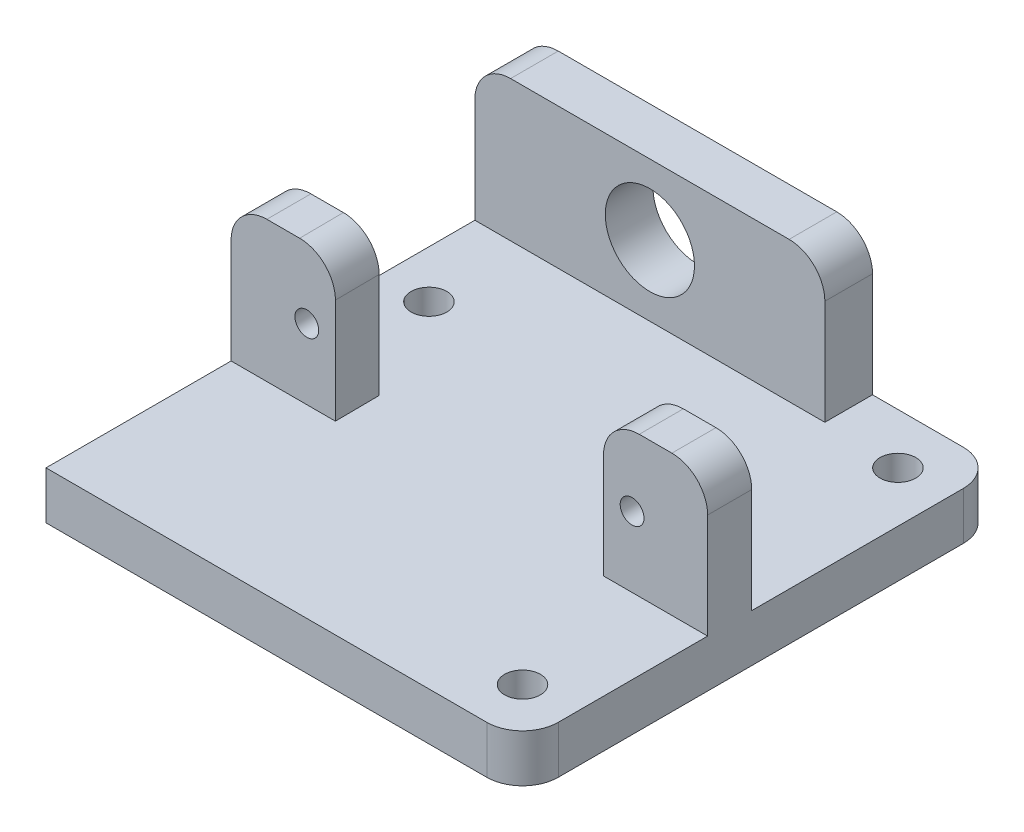
ISO-10303-21;
HEADER;
FILE_DESCRIPTION(('STEP AP214'),'2;1');
FILE_NAME('part.step','',(''),(''),'','','');
FILE_SCHEMA(('AUTOMOTIVE_DESIGN { 1 0 10303 214 1 1 1 1 }'));
ENDSEC;
DATA;
#1=APPLICATION_CONTEXT('core data for automotive mechanical design processes');
#2=APPLICATION_PROTOCOL_DEFINITION('international standard','automotive_design',2000,#1);
#3=PRODUCT_CONTEXT('',#1,'mechanical');
#4=PRODUCT('Part','Part','',(#3));
#5=PRODUCT_RELATED_PRODUCT_CATEGORY('part','',(#4));
#6=PRODUCT_DEFINITION_FORMATION('','',#4);
#7=PRODUCT_DEFINITION_CONTEXT('part definition',#1,'design');
#8=PRODUCT_DEFINITION('design','',#6,#7);
#9=PRODUCT_DEFINITION_SHAPE('','',#8);
#10=(LENGTH_UNIT() NAMED_UNIT(*) SI_UNIT(.MILLI.,.METRE.));
#11=(NAMED_UNIT(*) PLANE_ANGLE_UNIT() SI_UNIT($,.RADIAN.));
#12=(NAMED_UNIT(*) SI_UNIT($,.STERADIAN.) SOLID_ANGLE_UNIT());
#13=UNCERTAINTY_MEASURE_WITH_UNIT(LENGTH_MEASURE(1.E-05),#10,'distance_accuracy_value','');
#14=(GEOMETRIC_REPRESENTATION_CONTEXT(3) GLOBAL_UNCERTAINTY_ASSIGNED_CONTEXT((#13)) GLOBAL_UNIT_ASSIGNED_CONTEXT((#10,
#11,#12)) REPRESENTATION_CONTEXT('',''));
#15=CARTESIAN_POINT('',(0.,0.,0.));
#16=DIRECTION('',(0.,0.,1.));
#17=DIRECTION('',(1.,0.,0.));
#18=AXIS2_PLACEMENT_3D('',#15,#16,#17);
#19=CARTESIAN_POINT('',(0.,4.,0.));
#20=DIRECTION('',(0.,-1.,0.));
#21=DIRECTION('',(0.,0.,-1.));
#22=AXIS2_PLACEMENT_3D('',#19,#20,#21);
#23=PLANE('',#22);
#24=CARTESIAN_POINT('',(15.7573593128807,4.,-15.7573593128807));
#25=DIRECTION('',(0.,1.,0.));
#26=DIRECTION('',(0.,0.,1.));
#27=AXIS2_PLACEMENT_3D('',#24,#25,#26);
#28=CIRCLE('',#27,1.5);
#29=CARTESIAN_POINT('',(15.7573593128807,4.,-14.2573593128807));
#30=VERTEX_POINT('',#29);
#31=EDGE_CURVE('E417',#30,#30,#28,.T.);
#32=ORIENTED_EDGE('',*,*,#31,.F.);
#33=EDGE_LOOP('',(#32));
#34=FACE_BOUND('',#33,.T.);
#35=CARTESIAN_POINT('',(15.7573593128807,4.,15.7573593128807));
#36=DIRECTION('',(0.,1.,0.));
#37=DIRECTION('',(0.,0.,1.));
#38=AXIS2_PLACEMENT_3D('',#35,#36,#37);
#39=CIRCLE('',#38,1.5);
#40=CARTESIAN_POINT('',(15.7573593128807,4.,17.2573593128807));
#41=VERTEX_POINT('',#40);
#42=EDGE_CURVE('E423',#41,#41,#39,.T.);
#43=ORIENTED_EDGE('',*,*,#42,.F.);
#44=EDGE_LOOP('',(#43));
#45=FACE_BOUND('',#44,.T.);
#46=CARTESIAN_POINT('',(-16.,4.,-8.14578966185309));
#47=DIRECTION('',(0.,1.,0.));
#48=DIRECTION('',(0.,0.,1.));
#49=AXIS2_PLACEMENT_3D('',#46,#47,#48);
#50=CIRCLE('',#49,1.5);
#51=CARTESIAN_POINT('',(-16.,4.,-6.64578966185308));
#52=VERTEX_POINT('',#51);
#53=EDGE_CURVE('E414',#52,#52,#50,.T.);
#54=ORIENTED_EDGE('',*,*,#53,.F.);
#55=EDGE_LOOP('',(#54));
#56=FACE_BOUND('',#55,.T.);
#57=DIRECTION('',(0.,0.,-1.));
#58=VECTOR('',#57,1.);
#59=CARTESIAN_POINT('',(20.,4.,20.));
#60=LINE('',#59,#58);
#61=CARTESIAN_POINT('',(20.,4.,0.761716698699549));
#62=VERTEX_POINT('',#61);
#63=CARTESIAN_POINT('',(20.,4.,-17.));
#64=VERTEX_POINT('',#63);
#65=EDGE_CURVE('E279',#62,#64,#60,.T.);
#66=ORIENTED_EDGE('',*,*,#65,.T.);
#67=CARTESIAN_POINT('',(17.,4.,-17.));
#68=DIRECTION('',(0.,-1.,0.));
#69=DIRECTION('',(0.,0.,-1.));
#70=AXIS2_PLACEMENT_3D('',#67,#68,#69);
#71=CIRCLE('',#70,3.);
#72=CARTESIAN_POINT('',(17.,4.,-20.));
#73=VERTEX_POINT('',#72);
#74=EDGE_CURVE('E42',#64,#73,#71,.F.);
#75=ORIENTED_EDGE('',*,*,#74,.T.);
#76=DIRECTION('',(-1.,0.,0.));
#77=VECTOR('',#76,1.);
#78=CARTESIAN_POINT('',(-20.,4.,-20.));
#79=LINE('',#78,#77);
#80=CARTESIAN_POINT('',(9.38,4.,-20.));
#81=VERTEX_POINT('',#80);
#82=EDGE_CURVE('E278',#73,#81,#79,.T.);
#83=ORIENTED_EDGE('',*,*,#82,.T.);
#84=DIRECTION('',(0.,0.,-1.));
#85=VECTOR('',#84,1.);
#86=CARTESIAN_POINT('',(9.38,4.,-16.));
#87=LINE('',#86,#85);
#88=CARTESIAN_POINT('',(9.38,4.,-16.));
#89=VERTEX_POINT('',#88);
#90=EDGE_CURVE('E217',#89,#81,#87,.T.);
#91=ORIENTED_EDGE('',*,*,#90,.F.);
#92=DIRECTION('',(1.,0.,0.));
#93=VECTOR('',#92,1.);
#94=CARTESIAN_POINT('',(9.38,4.,-16.));
#95=LINE('',#94,#93);
#96=CARTESIAN_POINT('',(-20.,4.,-16.));
#97=VERTEX_POINT('',#96);
#98=EDGE_CURVE('E196',#97,#89,#95,.T.);
#99=ORIENTED_EDGE('',*,*,#98,.F.);
#100=DIRECTION('',(0.,0.,1.));
#101=VECTOR('',#100,1.);
#102=CARTESIAN_POINT('',(-20.,4.,20.));
#103=LINE('',#102,#101);
#104=CARTESIAN_POINT('',(-20.,4.,0.761716698699547));
#105=VERTEX_POINT('',#104);
#106=EDGE_CURVE('E205',#97,#105,#103,.T.);
#107=ORIENTED_EDGE('',*,*,#106,.T.);
#108=DIRECTION('',(-1.,0.,0.));
#109=VECTOR('',#108,1.);
#110=CARTESIAN_POINT('',(-20.,4.,0.761716698699547));
#111=LINE('',#110,#109);
#112=CARTESIAN_POINT('',(-11.2760695865092,4.,0.761716698699547));
#113=VERTEX_POINT('',#112);
#114=EDGE_CURVE('E265',#113,#105,#111,.T.);
#115=ORIENTED_EDGE('',*,*,#114,.F.);
#116=DIRECTION('',(-0.00844114842498578,0.,-0.999964372871988));
#117=VECTOR('',#116,1.);
#118=CARTESIAN_POINT('',(-11.2760695865092,4.,0.761716698699547));
#119=LINE('',#118,#117);
#120=CARTESIAN_POINT('',(-11.2448362245817,4.,4.46171669869955));
#121=VERTEX_POINT('',#120);
#122=EDGE_CURVE('E254',#121,#113,#119,.T.);
#123=ORIENTED_EDGE('',*,*,#122,.F.);
#124=DIRECTION('',(1.,0.,0.));
#125=VECTOR('',#124,1.);
#126=CARTESIAN_POINT('',(-20.,4.,4.46171669869955));
#127=LINE('',#126,#125);
#128=CARTESIAN_POINT('',(-20.,4.,4.46171669869955));
#129=VERTEX_POINT('',#128);
#130=EDGE_CURVE('E259',#129,#121,#127,.T.);
#131=ORIENTED_EDGE('',*,*,#130,.F.);
#132=CARTESIAN_POINT('',(-20.,4.,20.));
#133=VERTEX_POINT('',#132);
#134=EDGE_CURVE('E213',#129,#133,#103,.T.);
#135=ORIENTED_EDGE('',*,*,#134,.T.);
#136=DIRECTION('',(1.,0.,0.));
#137=VECTOR('',#136,1.);
#138=CARTESIAN_POINT('',(-20.,4.,20.));
#139=LINE('',#138,#137);
#140=CARTESIAN_POINT('',(17.,4.,20.));
#141=VERTEX_POINT('',#140);
#142=EDGE_CURVE('E212',#133,#141,#139,.T.);
#143=ORIENTED_EDGE('',*,*,#142,.T.);
#144=CARTESIAN_POINT('',(17.,4.,17.));
#145=DIRECTION('',(0.,-1.,0.));
#146=DIRECTION('',(0.,0.,-1.));
#147=AXIS2_PLACEMENT_3D('',#144,#145,#146);
#148=CIRCLE('',#147,3.);
#149=CARTESIAN_POINT('',(20.,4.,17.));
#150=VERTEX_POINT('',#149);
#151=EDGE_CURVE('E359',#141,#150,#148,.F.);
#152=ORIENTED_EDGE('',*,*,#151,.T.);
#153=CARTESIAN_POINT('',(20.,4.,4.46171669869955));
#154=VERTEX_POINT('',#153);
#155=EDGE_CURVE('E276',#150,#154,#60,.T.);
#156=ORIENTED_EDGE('',*,*,#155,.T.);
#157=DIRECTION('',(1.,0.,0.));
#158=VECTOR('',#157,1.);
#159=CARTESIAN_POINT('',(11.2604529055455,4.,4.46171669869955));
#160=LINE('',#159,#158);
#161=CARTESIAN_POINT('',(11.2604529055455,4.,4.46171669869955));
#162=VERTEX_POINT('',#161);
#163=EDGE_CURVE('E235',#162,#154,#160,.T.);
#164=ORIENTED_EDGE('',*,*,#163,.F.);
#165=DIRECTION('',(0.,0.,1.));
#166=VECTOR('',#165,1.);
#167=CARTESIAN_POINT('',(11.2604529055455,4.,0.761716698699549));
#168=LINE('',#167,#166);
#169=CARTESIAN_POINT('',(11.2604529055455,4.,0.761716698699549));
#170=VERTEX_POINT('',#169);
#171=EDGE_CURVE('E241',#170,#162,#168,.T.);
#172=ORIENTED_EDGE('',*,*,#171,.F.);
#173=DIRECTION('',(-1.,0.,0.));
#174=VECTOR('',#173,1.);
#175=CARTESIAN_POINT('',(11.2604529055455,4.,0.761716698699549));
#176=LINE('',#175,#174);
#177=EDGE_CURVE('E230',#62,#170,#176,.T.);
#178=ORIENTED_EDGE('',*,*,#177,.F.);
#179=EDGE_LOOP('',(#66,#75,#83,#91,#99,#107,#115,#123,#131,#135,#143,#152,#156,#164,#172,#178));
#180=FACE_BOUND('',#179,.T.);
#181=ADVANCED_FACE('F34',(#34,#45,#56,#180),#23,.F.);
#182=CARTESIAN_POINT('',(20.,4.,20.));
#183=DIRECTION('',(-1.,0.,0.));
#184=DIRECTION('',(0.,0.,1.));
#185=AXIS2_PLACEMENT_3D('',#182,#183,#184);
#186=PLANE('',#185);
#187=DIRECTION('',(0.,0.,-1.));
#188=VECTOR('',#187,1.);
#189=CARTESIAN_POINT('',(20.,0.,20.));
#190=LINE('',#189,#188);
#191=CARTESIAN_POINT('',(20.,0.,17.));
#192=VERTEX_POINT('',#191);
#193=CARTESIAN_POINT('',(20.,0.,-17.));
#194=VERTEX_POINT('',#193);
#195=EDGE_CURVE('E275',#192,#194,#190,.T.);
#196=ORIENTED_EDGE('',*,*,#195,.T.);
#197=DIRECTION('',(0.,-1.,0.));
#198=VECTOR('',#197,1.);
#199=CARTESIAN_POINT('',(20.,4.,-17.));
#200=LINE('',#199,#198);
#201=EDGE_CURVE('E55',#194,#64,#200,.F.);
#202=ORIENTED_EDGE('',*,*,#201,.T.);
#203=ORIENTED_EDGE('',*,*,#65,.F.);
#204=DIRECTION('',(0.,-1.,0.));
#205=VECTOR('',#204,1.);
#206=CARTESIAN_POINT('',(20.,15.8,0.761716698699549));
#207=LINE('',#206,#205);
#208=CARTESIAN_POINT('',(20.,12.8,0.761716698699549));
#209=VERTEX_POINT('',#208);
#210=EDGE_CURVE('E252',#209,#62,#207,.T.);
#211=ORIENTED_EDGE('',*,*,#210,.F.);
#212=DIRECTION('',(0.,0.,-1.));
#213=VECTOR('',#212,1.);
#214=CARTESIAN_POINT('',(20.,12.8,4.46171669869955));
#215=LINE('',#214,#213);
#216=CARTESIAN_POINT('',(20.,12.8,4.46171669869955));
#217=VERTEX_POINT('',#216);
#218=EDGE_CURVE('E305',#209,#217,#215,.F.);
#219=ORIENTED_EDGE('',*,*,#218,.T.);
#220=DIRECTION('',(0.,-1.,0.));
#221=VECTOR('',#220,1.);
#222=CARTESIAN_POINT('',(20.,15.8,4.46171669869955));
#223=LINE('',#222,#221);
#224=EDGE_CURVE('E238',#217,#154,#223,.T.);
#225=ORIENTED_EDGE('',*,*,#224,.T.);
#226=ORIENTED_EDGE('',*,*,#155,.F.);
#227=DIRECTION('',(0.,-1.,0.));
#228=VECTOR('',#227,1.);
#229=CARTESIAN_POINT('',(20.,4.,17.));
#230=LINE('',#229,#228);
#231=EDGE_CURVE('E355',#150,#192,#230,.T.);
#232=ORIENTED_EDGE('',*,*,#231,.T.);
#233=EDGE_LOOP('',(#196,#202,#203,#211,#219,#225,#226,#232));
#234=FACE_BOUND('',#233,.T.);
#235=ADVANCED_FACE('F374',(#234),#186,.F.);
#236=CARTESIAN_POINT('',(-20.,4.,-20.));
#237=DIRECTION('',(0.,0.,1.));
#238=DIRECTION('',(1.,0.,0.));
#239=AXIS2_PLACEMENT_3D('',#236,#237,#238);
#240=PLANE('',#239);
#241=CARTESIAN_POINT('',(-5.31,9.9,-20.));
#242=DIRECTION('',(0.,0.,1.));
#243=DIRECTION('',(1.,0.,0.));
#244=AXIS2_PLACEMENT_3D('',#241,#242,#243);
#245=CIRCLE('',#244,3.745);
#246=CARTESIAN_POINT('',(-1.565,9.9,-20.));
#247=VERTEX_POINT('',#246);
#248=EDGE_CURVE('E223',#247,#247,#245,.T.);
#249=ORIENTED_EDGE('',*,*,#248,.T.);
#250=EDGE_LOOP('',(#249));
#251=FACE_BOUND('',#250,.T.);
#252=ORIENTED_EDGE('',*,*,#82,.F.);
#253=DIRECTION('',(0.,-1.,0.));
#254=VECTOR('',#253,1.);
#255=CARTESIAN_POINT('',(17.,4.,-20.));
#256=LINE('',#255,#254);
#257=CARTESIAN_POINT('',(17.,0.,-20.));
#258=VERTEX_POINT('',#257);
#259=EDGE_CURVE('E348',#73,#258,#256,.T.);
#260=ORIENTED_EDGE('',*,*,#259,.T.);
#261=DIRECTION('',(-1.,0.,0.));
#262=VECTOR('',#261,1.);
#263=CARTESIAN_POINT('',(-20.,0.,-20.));
#264=LINE('',#263,#262);
#265=CARTESIAN_POINT('',(-20.,0.,-20.));
#266=VERTEX_POINT('',#265);
#267=EDGE_CURVE('E284',#258,#266,#264,.T.);
#268=ORIENTED_EDGE('',*,*,#267,.T.);
#269=DIRECTION('',(0.,-1.,0.));
#270=VECTOR('',#269,1.);
#271=CARTESIAN_POINT('',(-20.,4.,-20.));
#272=LINE('',#271,#270);
#273=CARTESIAN_POINT('',(-20.,12.8,-20.));
#274=VERTEX_POINT('',#273);
#275=EDGE_CURVE('E292',#274,#266,#272,.T.);
#276=ORIENTED_EDGE('',*,*,#275,.F.);
#277=CARTESIAN_POINT('',(-17.,12.8,-20.));
#278=DIRECTION('',(0.,0.,1.));
#279=DIRECTION('',(1.,0.,0.));
#280=AXIS2_PLACEMENT_3D('',#277,#278,#279);
#281=CIRCLE('',#280,3.);
#282=CARTESIAN_POINT('',(-17.,15.8,-20.));
#283=VERTEX_POINT('',#282);
#284=EDGE_CURVE('E319',#274,#283,#281,.F.);
#285=ORIENTED_EDGE('',*,*,#284,.T.);
#286=DIRECTION('',(-1.,0.,0.));
#287=VECTOR('',#286,1.);
#288=CARTESIAN_POINT('',(9.38,15.8,-20.));
#289=LINE('',#288,#287);
#290=CARTESIAN_POINT('',(6.38,15.8,-20.));
#291=VERTEX_POINT('',#290);
#292=EDGE_CURVE('E218',#291,#283,#289,.T.);
#293=ORIENTED_EDGE('',*,*,#292,.F.);
#294=CARTESIAN_POINT('',(6.38,12.8,-20.));
#295=DIRECTION('',(0.,0.,1.));
#296=DIRECTION('',(1.,0.,0.));
#297=AXIS2_PLACEMENT_3D('',#294,#295,#296);
#298=CIRCLE('',#297,3.);
#299=CARTESIAN_POINT('',(9.38,12.8,-20.));
#300=VERTEX_POINT('',#299);
#301=EDGE_CURVE('E321',#291,#300,#298,.F.);
#302=ORIENTED_EDGE('',*,*,#301,.T.);
#303=DIRECTION('',(0.,-1.,0.));
#304=VECTOR('',#303,1.);
#305=CARTESIAN_POINT('',(9.38,15.8,-20.));
#306=LINE('',#305,#304);
#307=EDGE_CURVE('E201',#300,#81,#306,.T.);
#308=ORIENTED_EDGE('',*,*,#307,.T.);
#309=EDGE_LOOP('',(#252,#260,#268,#276,#285,#293,#302,#308));
#310=FACE_BOUND('',#309,.T.);
#311=ADVANCED_FACE('F366',(#251,#310),#240,.F.);
#312=CARTESIAN_POINT('',(-20.,4.,20.));
#313=DIRECTION('',(1.,0.,0.));
#314=DIRECTION('',(0.,0.,-1.));
#315=AXIS2_PLACEMENT_3D('',#312,#313,#314);
#316=PLANE('',#315);
#317=DIRECTION('',(0.,-1.,0.));
#318=VECTOR('',#317,1.);
#319=CARTESIAN_POINT('',(-20.,15.8,-16.));
#320=LINE('',#319,#318);
#321=CARTESIAN_POINT('',(-20.,12.8,-16.));
#322=VERTEX_POINT('',#321);
#323=EDGE_CURVE('E191',#322,#97,#320,.T.);
#324=ORIENTED_EDGE('',*,*,#323,.F.);
#325=DIRECTION('',(0.,0.,1.));
#326=VECTOR('',#325,1.);
#327=CARTESIAN_POINT('',(-20.,12.8,-20.));
#328=LINE('',#327,#326);
#329=EDGE_CURVE('E330',#322,#274,#328,.F.);
#330=ORIENTED_EDGE('',*,*,#329,.T.);
#331=ORIENTED_EDGE('',*,*,#275,.T.);
#332=DIRECTION('',(0.,0.,1.));
#333=VECTOR('',#332,1.);
#334=CARTESIAN_POINT('',(-20.,0.,20.));
#335=LINE('',#334,#333);
#336=CARTESIAN_POINT('',(-20.,0.,20.));
#337=VERTEX_POINT('',#336);
#338=EDGE_CURVE('E286',#266,#337,#335,.T.);
#339=ORIENTED_EDGE('',*,*,#338,.T.);
#340=DIRECTION('',(0.,-1.,0.));
#341=VECTOR('',#340,1.);
#342=CARTESIAN_POINT('',(-20.,4.,20.));
#343=LINE('',#342,#341);
#344=EDGE_CURVE('E282',#133,#337,#343,.T.);
#345=ORIENTED_EDGE('',*,*,#344,.F.);
#346=ORIENTED_EDGE('',*,*,#134,.F.);
#347=DIRECTION('',(0.,-1.,0.));
#348=VECTOR('',#347,1.);
#349=CARTESIAN_POINT('',(-20.,15.8,4.46171669869955));
#350=LINE('',#349,#348);
#351=CARTESIAN_POINT('',(-20.,12.8,4.46171669869955));
#352=VERTEX_POINT('',#351);
#353=EDGE_CURVE('E270',#352,#129,#350,.T.);
#354=ORIENTED_EDGE('',*,*,#353,.F.);
#355=DIRECTION('',(0.,0.,1.));
#356=VECTOR('',#355,1.);
#357=CARTESIAN_POINT('',(-20.,12.8,0.761716698699547));
#358=LINE('',#357,#356);
#359=CARTESIAN_POINT('',(-20.,12.8,0.761716698699547));
#360=VERTEX_POINT('',#359);
#361=EDGE_CURVE('E328',#352,#360,#358,.F.);
#362=ORIENTED_EDGE('',*,*,#361,.T.);
#363=DIRECTION('',(0.,-1.,0.));
#364=VECTOR('',#363,1.);
#365=CARTESIAN_POINT('',(-20.,15.8,0.761716698699547));
#366=LINE('',#365,#364);
#367=EDGE_CURVE('E208',#360,#105,#366,.T.);
#368=ORIENTED_EDGE('',*,*,#367,.T.);
#369=ORIENTED_EDGE('',*,*,#106,.F.);
#370=EDGE_LOOP('',(#324,#330,#331,#339,#345,#346,#354,#362,#368,#369));
#371=FACE_BOUND('',#370,.T.);
#372=ADVANCED_FACE('F206',(#371),#316,.F.);
#373=CARTESIAN_POINT('',(-20.,4.,20.));
#374=DIRECTION('',(0.,0.,-1.));
#375=DIRECTION('',(-1.,0.,0.));
#376=AXIS2_PLACEMENT_3D('',#373,#374,#375);
#377=PLANE('',#376);
#378=DIRECTION('',(1.,0.,0.));
#379=VECTOR('',#378,1.);
#380=CARTESIAN_POINT('',(-20.,0.,20.));
#381=LINE('',#380,#379);
#382=CARTESIAN_POINT('',(17.,0.,20.));
#383=VERTEX_POINT('',#382);
#384=EDGE_CURVE('E288',#337,#383,#381,.T.);
#385=ORIENTED_EDGE('',*,*,#384,.T.);
#386=DIRECTION('',(0.,-1.,0.));
#387=VECTOR('',#386,1.);
#388=CARTESIAN_POINT('',(17.,4.,20.));
#389=LINE('',#388,#387);
#390=EDGE_CURVE('E11',#383,#141,#389,.F.);
#391=ORIENTED_EDGE('',*,*,#390,.T.);
#392=ORIENTED_EDGE('',*,*,#142,.F.);
#393=ORIENTED_EDGE('',*,*,#344,.T.);
#394=EDGE_LOOP('',(#385,#391,#392,#393));
#395=FACE_BOUND('',#394,.T.);
#396=ADVANCED_FACE('F380',(#395),#377,.F.);
#397=CARTESIAN_POINT('',(0.,0.,0.));
#398=DIRECTION('',(0.,-1.,0.));
#399=DIRECTION('',(0.,0.,-1.));
#400=AXIS2_PLACEMENT_3D('',#397,#398,#399);
#401=PLANE('',#400);
#402=CARTESIAN_POINT('',(15.7573593128807,0.,-15.7573593128807));
#403=DIRECTION('',(0.,1.,0.));
#404=DIRECTION('',(0.,0.,1.));
#405=AXIS2_PLACEMENT_3D('',#402,#403,#404);
#406=CIRCLE('',#405,1.5);
#407=CARTESIAN_POINT('',(15.7573593128807,0.,-14.2573593128807));
#408=VERTEX_POINT('',#407);
#409=EDGE_CURVE('E426',#408,#408,#406,.T.);
#410=ORIENTED_EDGE('',*,*,#409,.T.);
#411=EDGE_LOOP('',(#410));
#412=FACE_BOUND('',#411,.T.);
#413=CARTESIAN_POINT('',(15.7573593128807,0.,15.7573593128807));
#414=DIRECTION('',(0.,1.,0.));
#415=DIRECTION('',(0.,0.,1.));
#416=AXIS2_PLACEMENT_3D('',#413,#414,#415);
#417=CIRCLE('',#416,1.5);
#418=CARTESIAN_POINT('',(15.7573593128807,0.,17.2573593128807));
#419=VERTEX_POINT('',#418);
#420=EDGE_CURVE('E420',#419,#419,#417,.T.);
#421=ORIENTED_EDGE('',*,*,#420,.T.);
#422=EDGE_LOOP('',(#421));
#423=FACE_BOUND('',#422,.T.);
#424=CARTESIAN_POINT('',(-16.,0.,-8.14578966185309));
#425=DIRECTION('',(0.,1.,0.));
#426=DIRECTION('',(0.,0.,1.));
#427=AXIS2_PLACEMENT_3D('',#424,#425,#426);
#428=CIRCLE('',#427,1.5);
#429=CARTESIAN_POINT('',(-16.,0.,-6.64578966185308));
#430=VERTEX_POINT('',#429);
#431=EDGE_CURVE('E413',#430,#430,#428,.T.);
#432=ORIENTED_EDGE('',*,*,#431,.T.);
#433=EDGE_LOOP('',(#432));
#434=FACE_BOUND('',#433,.T.);
#435=ORIENTED_EDGE('',*,*,#267,.F.);
#436=CARTESIAN_POINT('',(17.,0.,-17.));
#437=DIRECTION('',(0.,-1.,0.));
#438=DIRECTION('',(0.,0.,-1.));
#439=AXIS2_PLACEMENT_3D('',#436,#437,#438);
#440=CIRCLE('',#439,3.);
#441=EDGE_CURVE('E353',#258,#194,#440,.T.);
#442=ORIENTED_EDGE('',*,*,#441,.T.);
#443=ORIENTED_EDGE('',*,*,#195,.F.);
#444=CARTESIAN_POINT('',(17.,0.,17.));
#445=DIRECTION('',(0.,-1.,0.));
#446=DIRECTION('',(0.,0.,-1.));
#447=AXIS2_PLACEMENT_3D('',#444,#445,#446);
#448=CIRCLE('',#447,3.);
#449=EDGE_CURVE('E351',#192,#383,#448,.T.);
#450=ORIENTED_EDGE('',*,*,#449,.T.);
#451=ORIENTED_EDGE('',*,*,#384,.F.);
#452=ORIENTED_EDGE('',*,*,#338,.F.);
#453=EDGE_LOOP('',(#435,#442,#443,#450,#451,#452));
#454=FACE_BOUND('',#453,.T.);
#455=ADVANCED_FACE('F372',(#412,#423,#434,#454),#401,.T.);
#456=CARTESIAN_POINT('',(-11.2760695865092,15.8,0.761716698699547));
#457=DIRECTION('',(-0.999964372871988,0.,0.00844114842498578));
#458=DIRECTION('',(0.00844114842498578,0.,0.999964372871988));
#459=AXIS2_PLACEMENT_3D('',#456,#457,#458);
#460=PLANE('',#459);
#461=DIRECTION('',(0.,-1.,0.));
#462=VECTOR('',#461,1.);
#463=CARTESIAN_POINT('',(-11.2760695865092,15.8,0.761716698699547));
#464=LINE('',#463,#462);
#465=CARTESIAN_POINT('',(-11.2760695865092,12.8,0.761716698699547));
#466=VERTEX_POINT('',#465);
#467=EDGE_CURVE('E273',#466,#113,#464,.T.);
#468=ORIENTED_EDGE('',*,*,#467,.F.);
#469=DIRECTION('',(-0.00844114842498578,0.,-0.999964372871988));
#470=VECTOR('',#469,1.);
#471=CARTESIAN_POINT('',(-11.2448362245817,12.8,4.46171669869955));
#472=LINE('',#471,#470);
#473=CARTESIAN_POINT('',(-11.2448362245817,12.8,4.46171669869955));
#474=VERTEX_POINT('',#473);
#475=EDGE_CURVE('E346',#466,#474,#472,.F.);
#476=ORIENTED_EDGE('',*,*,#475,.T.);
#477=DIRECTION('',(0.,-1.,0.));
#478=VECTOR('',#477,1.);
#479=CARTESIAN_POINT('',(-11.2448362245817,15.8,4.46171669869955));
#480=LINE('',#479,#478);
#481=EDGE_CURVE('E262',#474,#121,#480,.T.);
#482=ORIENTED_EDGE('',*,*,#481,.T.);
#483=ORIENTED_EDGE('',*,*,#122,.T.);
#484=EDGE_LOOP('',(#468,#476,#482,#483));
#485=FACE_BOUND('',#484,.T.);
#486=ADVANCED_FACE('F502',(#485),#460,.F.);
#487=CARTESIAN_POINT('',(-20.,15.8,0.761716698699547));
#488=DIRECTION('',(0.,0.,1.));
#489=DIRECTION('',(1.,0.,0.));
#490=AXIS2_PLACEMENT_3D('',#487,#488,#489);
#491=PLANE('',#490);
#492=CARTESIAN_POINT('',(-13.6448362245818,9.9,0.761716698699547));
#493=DIRECTION('',(0.,0.,1.));
#494=DIRECTION('',(1.,0.,0.));
#495=AXIS2_PLACEMENT_3D('',#492,#493,#494);
#496=CIRCLE('',#495,1.);
#497=CARTESIAN_POINT('',(-12.6448362245817,9.9,0.761716698699547));
#498=VERTEX_POINT('',#497);
#499=EDGE_CURVE('E399',#498,#498,#496,.F.);
#500=ORIENTED_EDGE('',*,*,#499,.F.);
#501=EDGE_LOOP('',(#500));
#502=FACE_BOUND('',#501,.T.);
#503=ORIENTED_EDGE('',*,*,#367,.F.);
#504=CARTESIAN_POINT('',(-17.,12.8,0.761716698699547));
#505=DIRECTION('',(0.,0.,1.));
#506=DIRECTION('',(1.,0.,0.));
#507=AXIS2_PLACEMENT_3D('',#504,#505,#506);
#508=CIRCLE('',#507,3.);
#509=CARTESIAN_POINT('',(-17.,15.8,0.761716698699547));
#510=VERTEX_POINT('',#509);
#511=EDGE_CURVE('E344',#360,#510,#508,.F.);
#512=ORIENTED_EDGE('',*,*,#511,.T.);
#513=DIRECTION('',(-1.,0.,0.));
#514=VECTOR('',#513,1.);
#515=CARTESIAN_POINT('',(-20.,15.8,0.761716698699547));
#516=LINE('',#515,#514);
#517=CARTESIAN_POINT('',(-14.2761764717012,15.8,0.761716698699547));
#518=VERTEX_POINT('',#517);
#519=EDGE_CURVE('E255',#518,#510,#516,.T.);
#520=ORIENTED_EDGE('',*,*,#519,.F.);
#521=CARTESIAN_POINT('',(-14.2761764717012,12.8,0.761716698699547));
#522=DIRECTION('',(0.,0.,1.));
#523=DIRECTION('',(1.,0.,0.));
#524=AXIS2_PLACEMENT_3D('',#521,#522,#523);
#525=ELLIPSE('',#524,3.00010688519205,3.);
#526=EDGE_CURVE('E342',#518,#466,#525,.F.);
#527=ORIENTED_EDGE('',*,*,#526,.T.);
#528=ORIENTED_EDGE('',*,*,#467,.T.);
#529=ORIENTED_EDGE('',*,*,#114,.T.);
#530=EDGE_LOOP('',(#503,#512,#520,#527,#528,#529));
#531=FACE_BOUND('',#530,.T.);
#532=ADVANCED_FACE('F498',(#502,#531),#491,.F.);
#533=CARTESIAN_POINT('',(-20.,15.8,4.46171669869955));
#534=DIRECTION('',(0.,0.,-1.));
#535=DIRECTION('',(-1.,0.,0.));
#536=AXIS2_PLACEMENT_3D('',#533,#534,#535);
#537=PLANE('',#536);
#538=CARTESIAN_POINT('',(-13.6448362245818,9.9,4.46171669869955));
#539=DIRECTION('',(0.,0.,1.));
#540=DIRECTION('',(1.,0.,0.));
#541=AXIS2_PLACEMENT_3D('',#538,#539,#540);
#542=CIRCLE('',#541,1.);
#543=CARTESIAN_POINT('',(-12.6448362245817,9.9,4.46171669869955));
#544=VERTEX_POINT('',#543);
#545=EDGE_CURVE('E404',#544,#544,#542,.T.);
#546=ORIENTED_EDGE('',*,*,#545,.F.);
#547=EDGE_LOOP('',(#546));
#548=FACE_BOUND('',#547,.T.);
#549=DIRECTION('',(1.,0.,0.));
#550=VECTOR('',#549,1.);
#551=CARTESIAN_POINT('',(-20.,15.8,4.46171669869955));
#552=LINE('',#551,#550);
#553=CARTESIAN_POINT('',(-17.,15.8,4.46171669869955));
#554=VERTEX_POINT('',#553);
#555=CARTESIAN_POINT('',(-14.2449431097738,15.8,4.46171669869955));
#556=VERTEX_POINT('',#555);
#557=EDGE_CURVE('E258',#554,#556,#552,.T.);
#558=ORIENTED_EDGE('',*,*,#557,.F.);
#559=CARTESIAN_POINT('',(-17.,12.8,4.46171669869955));
#560=DIRECTION('',(0.,0.,-1.));
#561=DIRECTION('',(-1.,0.,0.));
#562=AXIS2_PLACEMENT_3D('',#559,#560,#561);
#563=CIRCLE('',#562,3.);
#564=EDGE_CURVE('E340',#554,#352,#563,.F.);
#565=ORIENTED_EDGE('',*,*,#564,.T.);
#566=ORIENTED_EDGE('',*,*,#353,.T.);
#567=ORIENTED_EDGE('',*,*,#130,.T.);
#568=ORIENTED_EDGE('',*,*,#481,.F.);
#569=CARTESIAN_POINT('',(-14.2449431097738,12.8,4.46171669869955));
#570=DIRECTION('',(0.,0.,-1.));
#571=DIRECTION('',(1.,0.,0.));
#572=AXIS2_PLACEMENT_3D('',#569,#570,#571);
#573=ELLIPSE('',#572,3.00010688519205,3.);
#574=EDGE_CURVE('E338',#474,#556,#573,.F.);
#575=ORIENTED_EDGE('',*,*,#574,.T.);
#576=EDGE_LOOP('',(#558,#565,#566,#567,#568,#575));
#577=FACE_BOUND('',#576,.T.);
#578=ADVANCED_FACE('F494',(#548,#577),#537,.F.);
#579=CARTESIAN_POINT('',(0.,15.8,0.));
#580=DIRECTION('',(0.,1.,0.));
#581=DIRECTION('',(0.,0.,1.));
#582=AXIS2_PLACEMENT_3D('',#579,#580,#581);
#583=PLANE('',#582);
#584=ORIENTED_EDGE('',*,*,#519,.T.);
#585=DIRECTION('',(0.,0.,1.));
#586=VECTOR('',#585,1.);
#587=CARTESIAN_POINT('',(-17.,15.8,4.46171669869955));
#588=LINE('',#587,#586);
#589=EDGE_CURVE('E335',#510,#554,#588,.T.);
#590=ORIENTED_EDGE('',*,*,#589,.T.);
#591=ORIENTED_EDGE('',*,*,#557,.T.);
#592=DIRECTION('',(-0.00844114842498578,0.,-0.999964372871988));
#593=VECTOR('',#592,1.);
#594=CARTESIAN_POINT('',(-14.2759627051251,15.8,0.787040143974504));
#595=LINE('',#594,#593);
#596=EDGE_CURVE('E332',#556,#518,#595,.T.);
#597=ORIENTED_EDGE('',*,*,#596,.T.);
#598=EDGE_LOOP('',(#584,#590,#591,#597));
#599=FACE_BOUND('',#598,.T.);
#600=ADVANCED_FACE('F490',(#599),#583,.T.);
#601=CARTESIAN_POINT('',(11.2604529055455,15.8,0.761716698699549));
#602=DIRECTION('',(0.,0.,1.));
#603=DIRECTION('',(1.,0.,0.));
#604=AXIS2_PLACEMENT_3D('',#601,#602,#603);
#605=PLANE('',#604);
#606=CARTESIAN_POINT('',(13.6604529055455,9.9,0.761716698699547));
#607=DIRECTION('',(0.,0.,1.));
#608=DIRECTION('',(1.,0.,0.));
#609=AXIS2_PLACEMENT_3D('',#606,#607,#608);
#610=CIRCLE('',#609,0.999999999999999);
#611=CARTESIAN_POINT('',(14.6604529055455,9.9,0.761716698699547));
#612=VERTEX_POINT('',#611);
#613=EDGE_CURVE('E407',#612,#612,#610,.F.);
#614=ORIENTED_EDGE('',*,*,#613,.F.);
#615=EDGE_LOOP('',(#614));
#616=FACE_BOUND('',#615,.T.);
#617=DIRECTION('',(-1.,0.,0.));
#618=VECTOR('',#617,1.);
#619=CARTESIAN_POINT('',(11.2604529055455,15.8,0.761716698699549));
#620=LINE('',#619,#618);
#621=CARTESIAN_POINT('',(17.,15.8,0.761716698699549));
#622=VERTEX_POINT('',#621);
#623=CARTESIAN_POINT('',(14.2604529055455,15.8,0.761716698699549));
#624=VERTEX_POINT('',#623);
#625=EDGE_CURVE('E231',#622,#624,#620,.T.);
#626=ORIENTED_EDGE('',*,*,#625,.F.);
#627=CARTESIAN_POINT('',(17.,12.8,0.761716698699549));
#628=DIRECTION('',(0.,0.,1.));
#629=DIRECTION('',(1.,0.,0.));
#630=AXIS2_PLACEMENT_3D('',#627,#628,#629);
#631=CIRCLE('',#630,3.);
#632=EDGE_CURVE('E303',#622,#209,#631,.F.);
#633=ORIENTED_EDGE('',*,*,#632,.T.);
#634=ORIENTED_EDGE('',*,*,#210,.T.);
#635=ORIENTED_EDGE('',*,*,#177,.T.);
#636=DIRECTION('',(0.,-1.,0.));
#637=VECTOR('',#636,1.);
#638=CARTESIAN_POINT('',(11.2604529055455,15.8,0.761716698699549));
#639=LINE('',#638,#637);
#640=CARTESIAN_POINT('',(11.2604529055455,12.8,0.761716698699549));
#641=VERTEX_POINT('',#640);
#642=EDGE_CURVE('E250',#641,#170,#639,.T.);
#643=ORIENTED_EDGE('',*,*,#642,.F.);
#644=CARTESIAN_POINT('',(14.2604529055455,12.8,0.761716698699549));
#645=DIRECTION('',(0.,0.,1.));
#646=DIRECTION('',(1.,0.,0.));
#647=AXIS2_PLACEMENT_3D('',#644,#645,#646);
#648=CIRCLE('',#647,3.);
#649=EDGE_CURVE('E301',#641,#624,#648,.F.);
#650=ORIENTED_EDGE('',*,*,#649,.T.);
#651=EDGE_LOOP('',(#626,#633,#634,#635,#643,#650));
#652=FACE_BOUND('',#651,.T.);
#653=ADVANCED_FACE('F486',(#616,#652),#605,.F.);
#654=CARTESIAN_POINT('',(11.2604529055455,15.8,0.761716698699549));
#655=DIRECTION('',(1.,0.,0.));
#656=DIRECTION('',(0.,0.,-1.));
#657=AXIS2_PLACEMENT_3D('',#654,#655,#656);
#658=PLANE('',#657);
#659=DIRECTION('',(0.,-1.,0.));
#660=VECTOR('',#659,1.);
#661=CARTESIAN_POINT('',(11.2604529055455,15.8,4.46171669869955));
#662=LINE('',#661,#660);
#663=CARTESIAN_POINT('',(11.2604529055455,12.8,4.46171669869955));
#664=VERTEX_POINT('',#663);
#665=EDGE_CURVE('E248',#664,#162,#662,.T.);
#666=ORIENTED_EDGE('',*,*,#665,.F.);
#667=DIRECTION('',(0.,0.,1.));
#668=VECTOR('',#667,1.);
#669=CARTESIAN_POINT('',(11.2604529055455,12.8,0.761716698699549));
#670=LINE('',#669,#668);
#671=EDGE_CURVE('E311',#664,#641,#670,.F.);
#672=ORIENTED_EDGE('',*,*,#671,.T.);
#673=ORIENTED_EDGE('',*,*,#642,.T.);
#674=ORIENTED_EDGE('',*,*,#171,.T.);
#675=EDGE_LOOP('',(#666,#672,#673,#674));
#676=FACE_BOUND('',#675,.T.);
#677=ADVANCED_FACE('F482',(#676),#658,.F.);
#678=CARTESIAN_POINT('',(11.2604529055455,15.8,4.46171669869955));
#679=DIRECTION('',(0.,0.,-1.));
#680=DIRECTION('',(-1.,0.,0.));
#681=AXIS2_PLACEMENT_3D('',#678,#679,#680);
#682=PLANE('',#681);
#683=CARTESIAN_POINT('',(13.6604529055455,9.9,4.46171669869955));
#684=DIRECTION('',(0.,0.,1.));
#685=DIRECTION('',(1.,0.,0.));
#686=AXIS2_PLACEMENT_3D('',#683,#684,#685);
#687=CIRCLE('',#686,0.999999999999999);
#688=CARTESIAN_POINT('',(14.6604529055455,9.9,4.46171669869955));
#689=VERTEX_POINT('',#688);
#690=EDGE_CURVE('E410',#689,#689,#687,.T.);
#691=ORIENTED_EDGE('',*,*,#690,.F.);
#692=EDGE_LOOP('',(#691));
#693=FACE_BOUND('',#692,.T.);
#694=ORIENTED_EDGE('',*,*,#224,.F.);
#695=CARTESIAN_POINT('',(17.,12.8,4.46171669869955));
#696=DIRECTION('',(0.,0.,-1.));
#697=DIRECTION('',(-1.,0.,0.));
#698=AXIS2_PLACEMENT_3D('',#695,#696,#697);
#699=CIRCLE('',#698,3.);
#700=CARTESIAN_POINT('',(17.,15.8,4.46171669869955));
#701=VERTEX_POINT('',#700);
#702=EDGE_CURVE('E309',#217,#701,#699,.F.);
#703=ORIENTED_EDGE('',*,*,#702,.T.);
#704=DIRECTION('',(1.,0.,0.));
#705=VECTOR('',#704,1.);
#706=CARTESIAN_POINT('',(11.2604529055455,15.8,4.46171669869955));
#707=LINE('',#706,#705);
#708=CARTESIAN_POINT('',(14.2604529055455,15.8,4.46171669869955));
#709=VERTEX_POINT('',#708);
#710=EDGE_CURVE('E234',#709,#701,#707,.T.);
#711=ORIENTED_EDGE('',*,*,#710,.F.);
#712=CARTESIAN_POINT('',(14.2604529055455,12.8,4.46171669869955));
#713=DIRECTION('',(0.,0.,-1.));
#714=DIRECTION('',(-1.,0.,0.));
#715=AXIS2_PLACEMENT_3D('',#712,#713,#714);
#716=CIRCLE('',#715,3.);
#717=EDGE_CURVE('E307',#709,#664,#716,.F.);
#718=ORIENTED_EDGE('',*,*,#717,.T.);
#719=ORIENTED_EDGE('',*,*,#665,.T.);
#720=ORIENTED_EDGE('',*,*,#163,.T.);
#721=EDGE_LOOP('',(#694,#703,#711,#718,#719,#720));
#722=FACE_BOUND('',#721,.T.);
#723=ADVANCED_FACE('F478',(#693,#722),#682,.F.);
#724=CARTESIAN_POINT('',(0.,15.8,0.));
#725=DIRECTION('',(0.,1.,0.));
#726=DIRECTION('',(0.,0.,1.));
#727=AXIS2_PLACEMENT_3D('',#724,#725,#726);
#728=PLANE('',#727);
#729=ORIENTED_EDGE('',*,*,#710,.T.);
#730=DIRECTION('',(0.,0.,-1.));
#731=VECTOR('',#730,1.);
#732=CARTESIAN_POINT('',(17.,15.8,0.761716698699549));
#733=LINE('',#732,#731);
#734=EDGE_CURVE('E298',#701,#622,#733,.T.);
#735=ORIENTED_EDGE('',*,*,#734,.T.);
#736=ORIENTED_EDGE('',*,*,#625,.T.);
#737=DIRECTION('',(0.,0.,1.));
#738=VECTOR('',#737,1.);
#739=CARTESIAN_POINT('',(14.2604529055455,15.8,4.46171669869955));
#740=LINE('',#739,#738);
#741=EDGE_CURVE('E295',#624,#709,#740,.T.);
#742=ORIENTED_EDGE('',*,*,#741,.T.);
#743=EDGE_LOOP('',(#729,#735,#736,#742));
#744=FACE_BOUND('',#743,.T.);
#745=ADVANCED_FACE('F474',(#744),#728,.T.);
#746=CARTESIAN_POINT('',(9.38,15.8,-16.));
#747=DIRECTION('',(-1.,0.,0.));
#748=DIRECTION('',(0.,0.,1.));
#749=AXIS2_PLACEMENT_3D('',#746,#747,#748);
#750=PLANE('',#749);
#751=ORIENTED_EDGE('',*,*,#307,.F.);
#752=DIRECTION('',(0.,0.,-1.));
#753=VECTOR('',#752,1.);
#754=CARTESIAN_POINT('',(9.38,12.8,-16.));
#755=LINE('',#754,#753);
#756=CARTESIAN_POINT('',(9.38,12.8,-16.));
#757=VERTEX_POINT('',#756);
#758=EDGE_CURVE('E323',#300,#757,#755,.F.);
#759=ORIENTED_EDGE('',*,*,#758,.T.);
#760=DIRECTION('',(0.,-1.,0.));
#761=VECTOR('',#760,1.);
#762=CARTESIAN_POINT('',(9.38,15.8,-16.));
#763=LINE('',#762,#761);
#764=EDGE_CURVE('E202',#757,#89,#763,.T.);
#765=ORIENTED_EDGE('',*,*,#764,.T.);
#766=ORIENTED_EDGE('',*,*,#90,.T.);
#767=EDGE_LOOP('',(#751,#759,#765,#766));
#768=FACE_BOUND('',#767,.T.);
#769=ADVANCED_FACE('F470',(#768),#750,.F.);
#770=CARTESIAN_POINT('',(9.38,15.8,-16.));
#771=DIRECTION('',(0.,0.,-1.));
#772=DIRECTION('',(-1.,0.,0.));
#773=AXIS2_PLACEMENT_3D('',#770,#771,#772);
#774=PLANE('',#773);
#775=CARTESIAN_POINT('',(-5.31,9.9,-16.));
#776=DIRECTION('',(0.,0.,1.));
#777=DIRECTION('',(1.,0.,0.));
#778=AXIS2_PLACEMENT_3D('',#775,#776,#777);
#779=CIRCLE('',#778,3.745);
#780=CARTESIAN_POINT('',(-1.565,9.9,-16.));
#781=VERTEX_POINT('',#780);
#782=EDGE_CURVE('E396',#781,#781,#779,.T.);
#783=ORIENTED_EDGE('',*,*,#782,.F.);
#784=EDGE_LOOP('',(#783));
#785=FACE_BOUND('',#784,.T.);
#786=ORIENTED_EDGE('',*,*,#764,.F.);
#787=CARTESIAN_POINT('',(6.38,12.8,-16.));
#788=DIRECTION('',(0.,0.,-1.));
#789=DIRECTION('',(-1.,0.,0.));
#790=AXIS2_PLACEMENT_3D('',#787,#788,#789);
#791=CIRCLE('',#790,3.);
#792=CARTESIAN_POINT('',(6.38,15.8,-16.));
#793=VERTEX_POINT('',#792);
#794=EDGE_CURVE('E326',#757,#793,#791,.F.);
#795=ORIENTED_EDGE('',*,*,#794,.T.);
#796=DIRECTION('',(1.,0.,0.));
#797=VECTOR('',#796,1.);
#798=CARTESIAN_POINT('',(-5.31,15.8,-16.));
#799=LINE('',#798,#797);
#800=CARTESIAN_POINT('',(-17.,15.8,-16.));
#801=VERTEX_POINT('',#800);
#802=EDGE_CURVE('E221',#801,#793,#799,.T.);
#803=ORIENTED_EDGE('',*,*,#802,.F.);
#804=CARTESIAN_POINT('',(-17.,12.8,-16.));
#805=DIRECTION('',(0.,0.,-1.));
#806=DIRECTION('',(-1.,0.,0.));
#807=AXIS2_PLACEMENT_3D('',#804,#805,#806);
#808=CIRCLE('',#807,3.);
#809=EDGE_CURVE('E198',#801,#322,#808,.F.);
#810=ORIENTED_EDGE('',*,*,#809,.T.);
#811=ORIENTED_EDGE('',*,*,#323,.T.);
#812=ORIENTED_EDGE('',*,*,#98,.T.);
#813=EDGE_LOOP('',(#786,#795,#803,#810,#811,#812));
#814=FACE_BOUND('',#813,.T.);
#815=ADVANCED_FACE('F194',(#785,#814),#774,.F.);
#816=CARTESIAN_POINT('',(0.,15.8,0.));
#817=DIRECTION('',(0.,1.,0.));
#818=DIRECTION('',(0.,0.,1.));
#819=AXIS2_PLACEMENT_3D('',#816,#817,#818);
#820=PLANE('',#819);
#821=ORIENTED_EDGE('',*,*,#802,.T.);
#822=DIRECTION('',(0.,0.,-1.));
#823=VECTOR('',#822,1.);
#824=CARTESIAN_POINT('',(6.38,15.8,-20.));
#825=LINE('',#824,#823);
#826=EDGE_CURVE('E316',#793,#291,#825,.T.);
#827=ORIENTED_EDGE('',*,*,#826,.T.);
#828=ORIENTED_EDGE('',*,*,#292,.T.);
#829=DIRECTION('',(0.,0.,1.));
#830=VECTOR('',#829,1.);
#831=CARTESIAN_POINT('',(-17.,15.8,-16.));
#832=LINE('',#831,#830);
#833=EDGE_CURVE('E313',#283,#801,#832,.T.);
#834=ORIENTED_EDGE('',*,*,#833,.T.);
#835=EDGE_LOOP('',(#821,#827,#828,#834));
#836=FACE_BOUND('',#835,.T.);
#837=ADVANCED_FACE('F392',(#836),#820,.T.);
#838=CARTESIAN_POINT('',(-5.31,9.9,-20.));
#839=DIRECTION('',(0.,0.,1.));
#840=DIRECTION('',(1.,0.,0.));
#841=AXIS2_PLACEMENT_3D('',#838,#839,#840);
#842=CYLINDRICAL_SURFACE('',#841,3.745);
#843=ORIENTED_EDGE('',*,*,#248,.F.);
#844=EDGE_LOOP('',(#843));
#845=FACE_BOUND('',#844,.T.);
#846=ORIENTED_EDGE('',*,*,#782,.T.);
#847=EDGE_LOOP('',(#846));
#848=FACE_BOUND('',#847,.T.);
#849=ADVANCED_FACE('F461',(#845,#848),#842,.F.);
#850=CARTESIAN_POINT('',(-13.6448362245818,9.9,-2.06671042604665));
#851=DIRECTION('',(0.,0.,1.));
#852=DIRECTION('',(1.,0.,0.));
#853=AXIS2_PLACEMENT_3D('',#850,#851,#852);
#854=CYLINDRICAL_SURFACE('',#853,1.);
#855=ORIENTED_EDGE('',*,*,#499,.T.);
#856=EDGE_LOOP('',(#855));
#857=FACE_BOUND('',#856,.T.);
#858=ORIENTED_EDGE('',*,*,#545,.T.);
#859=EDGE_LOOP('',(#858));
#860=FACE_BOUND('',#859,.T.);
#861=ADVANCED_FACE('F453',(#857,#860),#854,.F.);
#862=CARTESIAN_POINT('',(13.6604529055455,9.9,-2.06671042604665));
#863=DIRECTION('',(0.,0.,1.));
#864=DIRECTION('',(1.,0.,0.));
#865=AXIS2_PLACEMENT_3D('',#862,#863,#864);
#866=CYLINDRICAL_SURFACE('',#865,0.999999999999999);
#867=ORIENTED_EDGE('',*,*,#613,.T.);
#868=EDGE_LOOP('',(#867));
#869=FACE_BOUND('',#868,.T.);
#870=ORIENTED_EDGE('',*,*,#690,.T.);
#871=EDGE_LOOP('',(#870));
#872=FACE_BOUND('',#871,.T.);
#873=ADVANCED_FACE('F444',(#869,#872),#866,.F.);
#874=CARTESIAN_POINT('',(-16.,0.,-8.14578966185309));
#875=DIRECTION('',(0.,1.,0.));
#876=DIRECTION('',(0.,0.,1.));
#877=AXIS2_PLACEMENT_3D('',#874,#875,#876);
#878=CYLINDRICAL_SURFACE('',#877,1.5);
#879=ORIENTED_EDGE('',*,*,#431,.F.);
#880=EDGE_LOOP('',(#879));
#881=FACE_BOUND('',#880,.T.);
#882=ORIENTED_EDGE('',*,*,#53,.T.);
#883=EDGE_LOOP('',(#882));
#884=FACE_BOUND('',#883,.T.);
#885=ADVANCED_FACE('F441',(#881,#884),#878,.F.);
#886=CARTESIAN_POINT('',(15.7573593128807,0.,15.7573593128807));
#887=DIRECTION('',(0.,1.,0.));
#888=DIRECTION('',(0.,0.,1.));
#889=AXIS2_PLACEMENT_3D('',#886,#887,#888);
#890=CYLINDRICAL_SURFACE('',#889,1.5);
#891=ORIENTED_EDGE('',*,*,#420,.F.);
#892=EDGE_LOOP('',(#891));
#893=FACE_BOUND('',#892,.T.);
#894=ORIENTED_EDGE('',*,*,#42,.T.);
#895=EDGE_LOOP('',(#894));
#896=FACE_BOUND('',#895,.T.);
#897=ADVANCED_FACE('F443',(#893,#896),#890,.F.);
#898=CARTESIAN_POINT('',(15.7573593128807,0.,-15.7573593128807));
#899=DIRECTION('',(0.,1.,0.));
#900=DIRECTION('',(0.,0.,1.));
#901=AXIS2_PLACEMENT_3D('',#898,#899,#900);
#902=CYLINDRICAL_SURFACE('',#901,1.5);
#903=ORIENTED_EDGE('',*,*,#409,.F.);
#904=EDGE_LOOP('',(#903));
#905=FACE_BOUND('',#904,.T.);
#906=ORIENTED_EDGE('',*,*,#31,.T.);
#907=EDGE_LOOP('',(#906));
#908=FACE_BOUND('',#907,.T.);
#909=ADVANCED_FACE('F432',(#905,#908),#902,.F.);
#910=CARTESIAN_POINT('',(17.,12.8,0.));
#911=DIRECTION('',(0.,0.,1.));
#912=DIRECTION('',(1.,0.,0.));
#913=AXIS2_PLACEMENT_3D('',#910,#911,#912);
#914=CYLINDRICAL_SURFACE('',#913,3.);
#915=ORIENTED_EDGE('',*,*,#702,.F.);
#916=ORIENTED_EDGE('',*,*,#218,.F.);
#917=ORIENTED_EDGE('',*,*,#632,.F.);
#918=ORIENTED_EDGE('',*,*,#734,.F.);
#919=EDGE_LOOP('',(#915,#916,#917,#918));
#920=FACE_BOUND('',#919,.T.);
#921=ADVANCED_FACE('F519',(#920),#914,.T.);
#922=CARTESIAN_POINT('',(14.2604529055455,12.8,0.));
#923=DIRECTION('',(0.,0.,-1.));
#924=DIRECTION('',(-1.,0.,0.));
#925=AXIS2_PLACEMENT_3D('',#922,#923,#924);
#926=CYLINDRICAL_SURFACE('',#925,3.);
#927=ORIENTED_EDGE('',*,*,#649,.F.);
#928=ORIENTED_EDGE('',*,*,#671,.F.);
#929=ORIENTED_EDGE('',*,*,#717,.F.);
#930=ORIENTED_EDGE('',*,*,#741,.F.);
#931=EDGE_LOOP('',(#927,#928,#929,#930));
#932=FACE_BOUND('',#931,.T.);
#933=ADVANCED_FACE('F522',(#932),#926,.T.);
#934=CARTESIAN_POINT('',(6.38,12.8,0.));
#935=DIRECTION('',(0.,0.,1.));
#936=DIRECTION('',(1.,0.,0.));
#937=AXIS2_PLACEMENT_3D('',#934,#935,#936);
#938=CYLINDRICAL_SURFACE('',#937,3.);
#939=ORIENTED_EDGE('',*,*,#794,.F.);
#940=ORIENTED_EDGE('',*,*,#758,.F.);
#941=ORIENTED_EDGE('',*,*,#301,.F.);
#942=ORIENTED_EDGE('',*,*,#826,.F.);
#943=EDGE_LOOP('',(#939,#940,#941,#942));
#944=FACE_BOUND('',#943,.T.);
#945=ADVANCED_FACE('F526',(#944),#938,.T.);
#946=CARTESIAN_POINT('',(-17.,12.8,0.));
#947=DIRECTION('',(0.,0.,-1.));
#948=DIRECTION('',(-1.,0.,0.));
#949=AXIS2_PLACEMENT_3D('',#946,#947,#948);
#950=CYLINDRICAL_SURFACE('',#949,3.);
#951=ORIENTED_EDGE('',*,*,#284,.F.);
#952=ORIENTED_EDGE('',*,*,#329,.F.);
#953=ORIENTED_EDGE('',*,*,#809,.F.);
#954=ORIENTED_EDGE('',*,*,#833,.F.);
#955=EDGE_LOOP('',(#951,#952,#953,#954));
#956=FACE_BOUND('',#955,.T.);
#957=ADVANCED_FACE('F389',(#956),#950,.T.);
#958=CARTESIAN_POINT('',(-17.,12.8,0.));
#959=DIRECTION('',(0.,0.,-1.));
#960=DIRECTION('',(-1.,0.,0.));
#961=AXIS2_PLACEMENT_3D('',#958,#959,#960);
#962=CYLINDRICAL_SURFACE('',#961,3.);
#963=ORIENTED_EDGE('',*,*,#511,.F.);
#964=ORIENTED_EDGE('',*,*,#361,.F.);
#965=ORIENTED_EDGE('',*,*,#564,.F.);
#966=ORIENTED_EDGE('',*,*,#589,.F.);
#967=EDGE_LOOP('',(#963,#964,#965,#966));
#968=FACE_BOUND('',#967,.T.);
#969=ADVANCED_FACE('F533',(#968),#962,.T.);
#970=CARTESIAN_POINT('',(-14.281588786126,12.8,0.120557305798869));
#971=DIRECTION('',(0.00844114842498578,0.,0.999964372871988));
#972=DIRECTION('',(0.999964372871988,0.,-0.00844114842498578));
#973=AXIS2_PLACEMENT_3D('',#970,#971,#972);
#974=CYLINDRICAL_SURFACE('',#973,3.);
#975=ORIENTED_EDGE('',*,*,#574,.F.);
#976=ORIENTED_EDGE('',*,*,#475,.F.);
#977=ORIENTED_EDGE('',*,*,#526,.F.);
#978=ORIENTED_EDGE('',*,*,#596,.F.);
#979=EDGE_LOOP('',(#975,#976,#977,#978));
#980=FACE_BOUND('',#979,.T.);
#981=ADVANCED_FACE('F536',(#980),#974,.T.);
#982=CARTESIAN_POINT('',(17.,4.,-17.));
#983=DIRECTION('',(0.,-1.,0.));
#984=DIRECTION('',(0.,0.,-1.));
#985=AXIS2_PLACEMENT_3D('',#982,#983,#984);
#986=CYLINDRICAL_SURFACE('',#985,3.);
#987=ORIENTED_EDGE('',*,*,#74,.F.);
#988=ORIENTED_EDGE('',*,*,#201,.F.);
#989=ORIENTED_EDGE('',*,*,#441,.F.);
#990=ORIENTED_EDGE('',*,*,#259,.F.);
#991=EDGE_LOOP('',(#987,#988,#989,#990));
#992=FACE_BOUND('',#991,.T.);
#993=ADVANCED_FACE('F369',(#992),#986,.T.);
#994=CARTESIAN_POINT('',(17.,4.,17.));
#995=DIRECTION('',(0.,-1.,0.));
#996=DIRECTION('',(0.,0.,-1.));
#997=AXIS2_PLACEMENT_3D('',#994,#995,#996);
#998=CYLINDRICAL_SURFACE('',#997,3.);
#999=ORIENTED_EDGE('',*,*,#151,.F.);
#1000=ORIENTED_EDGE('',*,*,#390,.F.);
#1001=ORIENTED_EDGE('',*,*,#449,.F.);
#1002=ORIENTED_EDGE('',*,*,#231,.F.);
#1003=EDGE_LOOP('',(#999,#1000,#1001,#1002));
#1004=FACE_BOUND('',#1003,.T.);
#1005=ADVANCED_FACE('F36',(#1004),#998,.T.);
#1006=CLOSED_SHELL('',(#181,#235,#311,#372,#396,#455,#486,#532,#578,#600,#653,#677,#723,#745,
#769,#815,#837,#849,#861,#873,#885,#897,#909,#921,#933,#945,#957,#969,#981,#993,#1005));
#1007=MANIFOLD_SOLID_BREP('B2',#1006);
#1008=ADVANCED_BREP_SHAPE_REPRESENTATION('',(#18,#1007),#14);
#1009=SHAPE_DEFINITION_REPRESENTATION(#9,#1008);
ENDSEC;
END-ISO-10303-21;
